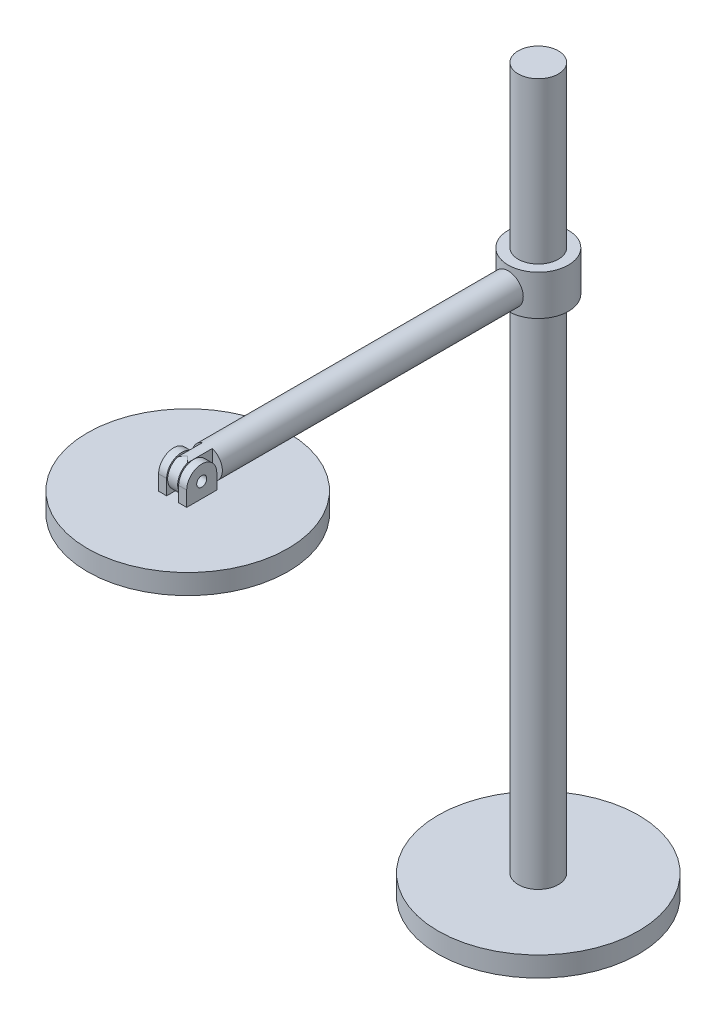
ISO-10303-21;
HEADER;
FILE_DESCRIPTION(('STEP AP214'),'2;1');
FILE_NAME('part.step','',(''),(''),'','','');
FILE_SCHEMA(('AUTOMOTIVE_DESIGN { 1 0 10303 214 1 1 1 1 }'));
ENDSEC;
DATA;
#1=APPLICATION_CONTEXT('core data for automotive mechanical design processes');
#2=APPLICATION_PROTOCOL_DEFINITION('international standard','automotive_design',2000,#1);
#3=PRODUCT_CONTEXT('',#1,'mechanical');
#4=PRODUCT('Part','Part','',(#3));
#5=PRODUCT_RELATED_PRODUCT_CATEGORY('part','',(#4));
#6=PRODUCT_DEFINITION_FORMATION('','',#4);
#7=PRODUCT_DEFINITION_CONTEXT('part definition',#1,'design');
#8=PRODUCT_DEFINITION('design','',#6,#7);
#9=PRODUCT_DEFINITION_SHAPE('','',#8);
#10=(LENGTH_UNIT() NAMED_UNIT(*) SI_UNIT(.MILLI.,.METRE.));
#11=(NAMED_UNIT(*) PLANE_ANGLE_UNIT() SI_UNIT($,.RADIAN.));
#12=(NAMED_UNIT(*) SI_UNIT($,.STERADIAN.) SOLID_ANGLE_UNIT());
#13=UNCERTAINTY_MEASURE_WITH_UNIT(LENGTH_MEASURE(1.E-05),#10,'distance_accuracy_value','');
#14=(GEOMETRIC_REPRESENTATION_CONTEXT(3) GLOBAL_UNCERTAINTY_ASSIGNED_CONTEXT((#13)) GLOBAL_UNIT_ASSIGNED_CONTEXT((#10,
#11,#12)) REPRESENTATION_CONTEXT('',''));
#15=CARTESIAN_POINT('',(0.,0.,0.));
#16=DIRECTION('',(0.,0.,1.));
#17=DIRECTION('',(1.,0.,0.));
#18=AXIS2_PLACEMENT_3D('',#15,#16,#17);
#19=CARTESIAN_POINT('',(0.,262.5,2.91433543964104E-13));
#20=DIRECTION('',(0.,1.,0.));
#21=DIRECTION('',(0.,0.,1.));
#22=AXIS2_PLACEMENT_3D('',#19,#20,#21);
#23=PLANE('',#22);
#24=CARTESIAN_POINT('',(0.,262.5,174.780705462269));
#25=DIRECTION('',(0.,1.,0.));
#26=DIRECTION('',(0.,0.,1.));
#27=AXIS2_PLACEMENT_3D('',#24,#25,#26);
#28=CIRCLE('',#27,50.);
#29=CARTESIAN_POINT('',(0.,262.5,224.780705462269));
#30=VERTEX_POINT('',#29);
#31=EDGE_CURVE('E169',#30,#30,#28,.T.);
#32=ORIENTED_EDGE('',*,*,#31,.T.);
#33=EDGE_LOOP('',(#32));
#34=FACE_BOUND('',#33,.T.);
#35=DIRECTION('',(0.,0.,1.));
#36=VECTOR('',#35,1.);
#37=CARTESIAN_POINT('',(3.,262.500000000001,1.48983907698869E-12));
#38=LINE('',#37,#36);
#39=CARTESIAN_POINT('',(3.,262.5,167.280705462269));
#40=VERTEX_POINT('',#39);
#41=CARTESIAN_POINT('',(3.,262.5,182.280705462269));
#42=VERTEX_POINT('',#41);
#43=EDGE_CURVE('E194',#40,#42,#38,.T.);
#44=ORIENTED_EDGE('',*,*,#43,.F.);
#45=DIRECTION('',(-1.,0.,0.));
#46=VECTOR('',#45,1.);
#47=CARTESIAN_POINT('',(7.,262.5,167.280705462269));
#48=LINE('',#47,#46);
#49=CARTESIAN_POINT('',(7.,262.5,167.280705462269));
#50=VERTEX_POINT('',#49);
#51=EDGE_CURVE('E202',#50,#40,#48,.T.);
#52=ORIENTED_EDGE('',*,*,#51,.F.);
#53=DIRECTION('',(0.,0.,1.));
#54=VECTOR('',#53,1.);
#55=CARTESIAN_POINT('',(7.,262.500000000001,1.48983907698869E-12));
#56=LINE('',#55,#54);
#57=CARTESIAN_POINT('',(7.,262.5,182.280705462269));
#58=VERTEX_POINT('',#57);
#59=EDGE_CURVE('E179',#50,#58,#56,.T.);
#60=ORIENTED_EDGE('',*,*,#59,.T.);
#61=DIRECTION('',(-1.,0.,0.));
#62=VECTOR('',#61,1.);
#63=CARTESIAN_POINT('',(7.,262.5,182.280705462269));
#64=LINE('',#63,#62);
#65=EDGE_CURVE('E64',#58,#42,#64,.T.);
#66=ORIENTED_EDGE('',*,*,#65,.T.);
#67=EDGE_LOOP('',(#44,#52,#60,#66));
#68=FACE_BOUND('',#67,.T.);
#69=DIRECTION('',(1.,0.,0.));
#70=VECTOR('',#69,1.);
#71=CARTESIAN_POINT('',(-7.,262.5,182.280705462269));
#72=LINE('',#71,#70);
#73=CARTESIAN_POINT('',(-7.,262.5,182.280705462269));
#74=VERTEX_POINT('',#73);
#75=CARTESIAN_POINT('',(-3.,262.5,182.280705462269));
#76=VERTEX_POINT('',#75);
#77=EDGE_CURVE('E76',#74,#76,#72,.T.);
#78=ORIENTED_EDGE('',*,*,#77,.F.);
#79=DIRECTION('',(0.,0.,1.));
#80=VECTOR('',#79,1.);
#81=CARTESIAN_POINT('',(-7.,262.500000000001,1.48983907698869E-12));
#82=LINE('',#81,#80);
#83=CARTESIAN_POINT('',(-7.,262.5,167.280705462269));
#84=VERTEX_POINT('',#83);
#85=EDGE_CURVE('E71',#84,#74,#82,.T.);
#86=ORIENTED_EDGE('',*,*,#85,.F.);
#87=DIRECTION('',(1.,0.,0.));
#88=VECTOR('',#87,1.);
#89=CARTESIAN_POINT('',(-7.,262.5,167.280705462269));
#90=LINE('',#89,#88);
#91=CARTESIAN_POINT('',(-3.,262.5,167.280705462269));
#92=VERTEX_POINT('',#91);
#93=EDGE_CURVE('E164',#84,#92,#90,.T.);
#94=ORIENTED_EDGE('',*,*,#93,.T.);
#95=DIRECTION('',(0.,0.,1.));
#96=VECTOR('',#95,1.);
#97=CARTESIAN_POINT('',(-3.,262.500000000001,1.48983907698869E-12));
#98=LINE('',#97,#96);
#99=EDGE_CURVE('E158',#92,#76,#98,.T.);
#100=ORIENTED_EDGE('',*,*,#99,.T.);
#101=EDGE_LOOP('',(#78,#86,#94,#100));
#102=FACE_BOUND('',#101,.T.);
#103=ADVANCED_FACE('F56',(#34,#68,#102),#23,.T.);
#104=CARTESIAN_POINT('',(7.,270.,174.780705462269));
#105=DIRECTION('',(-1.,0.,0.));
#106=DIRECTION('',(0.,0.,1.));
#107=AXIS2_PLACEMENT_3D('',#104,#105,#106);
#108=CYLINDRICAL_SURFACE('',#107,7.50000000000003);
#109=CARTESIAN_POINT('',(3.,270.,174.780705462269));
#110=DIRECTION('',(1.,0.,0.));
#111=DIRECTION('',(0.,0.,-1.));
#112=AXIS2_PLACEMENT_3D('',#109,#110,#111);
#113=CIRCLE('',#112,7.50000000000003);
#114=CARTESIAN_POINT('',(3.,270.,167.280705462269));
#115=VERTEX_POINT('',#114);
#116=CARTESIAN_POINT('',(3.,270.,182.280705462269));
#117=VERTEX_POINT('',#116);
#118=EDGE_CURVE('E172',#115,#117,#113,.T.);
#119=ORIENTED_EDGE('',*,*,#118,.T.);
#120=DIRECTION('',(-1.,0.,0.));
#121=VECTOR('',#120,1.);
#122=CARTESIAN_POINT('',(7.,270.,182.280705462269));
#123=LINE('',#122,#121);
#124=CARTESIAN_POINT('',(7.,270.,182.280705462269));
#125=VERTEX_POINT('',#124);
#126=EDGE_CURVE('E12',#125,#117,#123,.T.);
#127=ORIENTED_EDGE('',*,*,#126,.F.);
#128=CARTESIAN_POINT('',(7.,270.,174.780705462269));
#129=DIRECTION('',(1.,0.,0.));
#130=DIRECTION('',(0.,0.,-1.));
#131=AXIS2_PLACEMENT_3D('',#128,#129,#130);
#132=CIRCLE('',#131,7.50000000000003);
#133=CARTESIAN_POINT('',(7.,270.,167.280705462269));
#134=VERTEX_POINT('',#133);
#135=EDGE_CURVE('E173',#134,#125,#132,.T.);
#136=ORIENTED_EDGE('',*,*,#135,.F.);
#137=DIRECTION('',(-1.,0.,0.));
#138=VECTOR('',#137,1.);
#139=CARTESIAN_POINT('',(7.,270.,167.280705462269));
#140=LINE('',#139,#138);
#141=EDGE_CURVE('E188',#134,#115,#140,.T.);
#142=ORIENTED_EDGE('',*,*,#141,.T.);
#143=EDGE_LOOP('',(#119,#127,#136,#142));
#144=FACE_BOUND('',#143,.T.);
#145=ADVANCED_FACE('F58',(#144),#108,.T.);
#146=CARTESIAN_POINT('',(7.,0.,182.280705462269));
#147=DIRECTION('',(0.,0.,-1.));
#148=DIRECTION('',(-1.,0.,0.));
#149=AXIS2_PLACEMENT_3D('',#146,#147,#148);
#150=PLANE('',#149);
#151=DIRECTION('',(0.,-1.,0.));
#152=VECTOR('',#151,1.);
#153=CARTESIAN_POINT('',(3.,0.,182.280705462269));
#154=LINE('',#153,#152);
#155=EDGE_CURVE('E191',#117,#42,#154,.T.);
#156=ORIENTED_EDGE('',*,*,#155,.T.);
#157=ORIENTED_EDGE('',*,*,#65,.F.);
#158=DIRECTION('',(0.,-1.,0.));
#159=VECTOR('',#158,1.);
#160=CARTESIAN_POINT('',(7.,0.,182.280705462269));
#161=LINE('',#160,#159);
#162=EDGE_CURVE('E176',#125,#58,#161,.T.);
#163=ORIENTED_EDGE('',*,*,#162,.F.);
#164=ORIENTED_EDGE('',*,*,#126,.T.);
#165=EDGE_LOOP('',(#156,#157,#163,#164));
#166=FACE_BOUND('',#165,.T.);
#167=ADVANCED_FACE('F209',(#166),#150,.F.);
#168=CARTESIAN_POINT('',(7.,0.,167.280705462269));
#169=DIRECTION('',(0.,0.,-1.));
#170=DIRECTION('',(-1.,0.,0.));
#171=AXIS2_PLACEMENT_3D('',#168,#169,#170);
#172=PLANE('',#171);
#173=DIRECTION('',(0.,-1.,0.));
#174=VECTOR('',#173,1.);
#175=CARTESIAN_POINT('',(3.,0.,167.280705462269));
#176=LINE('',#175,#174);
#177=EDGE_CURVE('E196',#115,#40,#176,.T.);
#178=ORIENTED_EDGE('',*,*,#177,.F.);
#179=ORIENTED_EDGE('',*,*,#141,.F.);
#180=DIRECTION('',(0.,-1.,0.));
#181=VECTOR('',#180,1.);
#182=CARTESIAN_POINT('',(7.,0.,167.280705462269));
#183=LINE('',#182,#181);
#184=EDGE_CURVE('E182',#134,#50,#183,.T.);
#185=ORIENTED_EDGE('',*,*,#184,.T.);
#186=ORIENTED_EDGE('',*,*,#51,.T.);
#187=EDGE_LOOP('',(#178,#179,#185,#186));
#188=FACE_BOUND('',#187,.T.);
#189=ADVANCED_FACE('F217',(#188),#172,.T.);
#190=CARTESIAN_POINT('',(7.,270.,174.780705462269));
#191=DIRECTION('',(-1.,0.,0.));
#192=DIRECTION('',(0.,0.,1.));
#193=AXIS2_PLACEMENT_3D('',#190,#191,#192);
#194=CYLINDRICAL_SURFACE('',#193,2.5);
#195=CARTESIAN_POINT('',(7.,270.,174.780705462269));
#196=DIRECTION('',(1.,0.,0.));
#197=DIRECTION('',(0.,0.,-1.));
#198=AXIS2_PLACEMENT_3D('',#195,#196,#197);
#199=CIRCLE('',#198,2.5);
#200=CARTESIAN_POINT('',(7.,270.,172.280705462269));
#201=VERTEX_POINT('',#200);
#202=EDGE_CURVE('E185',#201,#201,#199,.T.);
#203=ORIENTED_EDGE('',*,*,#202,.T.);
#204=EDGE_LOOP('',(#203));
#205=FACE_BOUND('',#204,.T.);
#206=CARTESIAN_POINT('',(3.,270.,174.780705462269));
#207=DIRECTION('',(1.,0.,0.));
#208=DIRECTION('',(0.,0.,-1.));
#209=AXIS2_PLACEMENT_3D('',#206,#207,#208);
#210=CIRCLE('',#209,2.5);
#211=CARTESIAN_POINT('',(3.,270.,172.280705462269));
#212=VERTEX_POINT('',#211);
#213=EDGE_CURVE('E177',#212,#212,#210,.T.);
#214=ORIENTED_EDGE('',*,*,#213,.F.);
#215=EDGE_LOOP('',(#214));
#216=FACE_BOUND('',#215,.T.);
#217=ADVANCED_FACE('F243',(#205,#216),#194,.F.);
#218=CARTESIAN_POINT('',(7.,0.,0.));
#219=DIRECTION('',(1.,0.,0.));
#220=DIRECTION('',(0.,0.,-1.));
#221=AXIS2_PLACEMENT_3D('',#218,#219,#220);
#222=PLANE('',#221);
#223=ORIENTED_EDGE('',*,*,#135,.T.);
#224=ORIENTED_EDGE('',*,*,#162,.T.);
#225=ORIENTED_EDGE('',*,*,#59,.F.);
#226=ORIENTED_EDGE('',*,*,#184,.F.);
#227=EDGE_LOOP('',(#223,#224,#225,#226));
#228=FACE_BOUND('',#227,.T.);
#229=ORIENTED_EDGE('',*,*,#202,.F.);
#230=EDGE_LOOP('',(#229));
#231=FACE_BOUND('',#230,.T.);
#232=ADVANCED_FACE('F221',(#228,#231),#222,.T.);
#233=CARTESIAN_POINT('',(3.,0.,0.));
#234=DIRECTION('',(1.,0.,0.));
#235=DIRECTION('',(0.,0.,-1.));
#236=AXIS2_PLACEMENT_3D('',#233,#234,#235);
#237=PLANE('',#236);
#238=ORIENTED_EDGE('',*,*,#118,.F.);
#239=ORIENTED_EDGE('',*,*,#177,.T.);
#240=ORIENTED_EDGE('',*,*,#43,.T.);
#241=ORIENTED_EDGE('',*,*,#155,.F.);
#242=EDGE_LOOP('',(#238,#239,#240,#241));
#243=FACE_BOUND('',#242,.T.);
#244=ORIENTED_EDGE('',*,*,#213,.T.);
#245=EDGE_LOOP('',(#244));
#246=FACE_BOUND('',#245,.T.);
#247=ADVANCED_FACE('F213',(#243,#246),#237,.F.);
#248=CARTESIAN_POINT('',(0.,262.5,174.780705462269));
#249=DIRECTION('',(0.,1.,0.));
#250=DIRECTION('',(0.,0.,1.));
#251=AXIS2_PLACEMENT_3D('',#248,#249,#250);
#252=CYLINDRICAL_SURFACE('',#251,50.);
#253=CARTESIAN_POINT('',(0.,252.5,174.780705462269));
#254=DIRECTION('',(0.,1.,0.));
#255=DIRECTION('',(0.,0.,1.));
#256=AXIS2_PLACEMENT_3D('',#253,#254,#255);
#257=CIRCLE('',#256,50.);
#258=CARTESIAN_POINT('',(0.,252.5,224.780705462269));
#259=VERTEX_POINT('',#258);
#260=EDGE_CURVE('E163',#259,#259,#257,.T.);
#261=ORIENTED_EDGE('',*,*,#260,.T.);
#262=EDGE_LOOP('',(#261));
#263=FACE_BOUND('',#262,.T.);
#264=ORIENTED_EDGE('',*,*,#31,.F.);
#265=EDGE_LOOP('',(#264));
#266=FACE_BOUND('',#265,.T.);
#267=ADVANCED_FACE('F237',(#263,#266),#252,.T.);
#268=CARTESIAN_POINT('',(0.,252.5,0.));
#269=DIRECTION('',(0.,1.,0.));
#270=DIRECTION('',(0.,0.,1.));
#271=AXIS2_PLACEMENT_3D('',#268,#269,#270);
#272=PLANE('',#271);
#273=CARTESIAN_POINT('',(0.,252.5,174.780705462269));
#274=DIRECTION('',(0.,-1.,0.));
#275=DIRECTION('',(0.,0.,-1.));
#276=AXIS2_PLACEMENT_3D('',#273,#274,#275);
#277=CIRCLE('',#276,40.);
#278=CARTESIAN_POINT('',(0.,252.5,134.780705462269));
#279=VERTEX_POINT('',#278);
#280=EDGE_CURVE('E146',#279,#279,#277,.T.);
#281=ORIENTED_EDGE('',*,*,#280,.F.);
#282=EDGE_LOOP('',(#281));
#283=FACE_BOUND('',#282,.T.);
#284=ORIENTED_EDGE('',*,*,#260,.F.);
#285=EDGE_LOOP('',(#284));
#286=FACE_BOUND('',#285,.T.);
#287=ADVANCED_FACE('F235',(#283,#286),#272,.F.);
#288=CARTESIAN_POINT('',(-7.,270.,174.780705462269));
#289=DIRECTION('',(1.,0.,0.));
#290=DIRECTION('',(0.,0.,-1.));
#291=AXIS2_PLACEMENT_3D('',#288,#289,#290);
#292=CYLINDRICAL_SURFACE('',#291,7.50000000000003);
#293=CARTESIAN_POINT('',(-3.,270.,174.780705462269));
#294=DIRECTION('',(1.,0.,0.));
#295=DIRECTION('',(0.,0.,-1.));
#296=AXIS2_PLACEMENT_3D('',#293,#294,#295);
#297=CIRCLE('',#296,7.50000000000003);
#298=CARTESIAN_POINT('',(-3.,270.,167.280705462269));
#299=VERTEX_POINT('',#298);
#300=CARTESIAN_POINT('',(-3.,270.,182.280705462269));
#301=VERTEX_POINT('',#300);
#302=EDGE_CURVE('E154',#299,#301,#297,.T.);
#303=ORIENTED_EDGE('',*,*,#302,.F.);
#304=DIRECTION('',(1.,0.,0.));
#305=VECTOR('',#304,1.);
#306=CARTESIAN_POINT('',(-7.,270.,167.280705462269));
#307=LINE('',#306,#305);
#308=CARTESIAN_POINT('',(-7.,270.,167.280705462269));
#309=VERTEX_POINT('',#308);
#310=EDGE_CURVE('E138',#309,#299,#307,.T.);
#311=ORIENTED_EDGE('',*,*,#310,.F.);
#312=CARTESIAN_POINT('',(-7.,270.,174.780705462269));
#313=DIRECTION('',(1.,0.,0.));
#314=DIRECTION('',(0.,0.,-1.));
#315=AXIS2_PLACEMENT_3D('',#312,#313,#314);
#316=CIRCLE('',#315,7.50000000000003);
#317=CARTESIAN_POINT('',(-7.,270.,182.280705462269));
#318=VERTEX_POINT('',#317);
#319=EDGE_CURVE('E135',#309,#318,#316,.T.);
#320=ORIENTED_EDGE('',*,*,#319,.T.);
#321=DIRECTION('',(1.,0.,0.));
#322=VECTOR('',#321,1.);
#323=CARTESIAN_POINT('',(-7.,270.,182.280705462269));
#324=LINE('',#323,#322);
#325=EDGE_CURVE('E119',#318,#301,#324,.T.);
#326=ORIENTED_EDGE('',*,*,#325,.T.);
#327=EDGE_LOOP('',(#303,#311,#320,#326));
#328=FACE_BOUND('',#327,.T.);
#329=ADVANCED_FACE('F137',(#328),#292,.T.);
#330=CARTESIAN_POINT('',(-7.,0.,167.280705462269));
#331=DIRECTION('',(0.,0.,1.));
#332=DIRECTION('',(1.,0.,0.));
#333=AXIS2_PLACEMENT_3D('',#330,#331,#332);
#334=PLANE('',#333);
#335=DIRECTION('',(0.,-1.,0.));
#336=VECTOR('',#335,1.);
#337=CARTESIAN_POINT('',(-3.,0.,167.280705462269));
#338=LINE('',#337,#336);
#339=EDGE_CURVE('E143',#299,#92,#338,.T.);
#340=ORIENTED_EDGE('',*,*,#339,.T.);
#341=ORIENTED_EDGE('',*,*,#93,.F.);
#342=DIRECTION('',(0.,-1.,0.));
#343=VECTOR('',#342,1.);
#344=CARTESIAN_POINT('',(-7.,0.,167.280705462269));
#345=LINE('',#344,#343);
#346=EDGE_CURVE('E150',#309,#84,#345,.T.);
#347=ORIENTED_EDGE('',*,*,#346,.F.);
#348=ORIENTED_EDGE('',*,*,#310,.T.);
#349=EDGE_LOOP('',(#340,#341,#347,#348));
#350=FACE_BOUND('',#349,.T.);
#351=ADVANCED_FACE('F284',(#350),#334,.F.);
#352=CARTESIAN_POINT('',(-7.,0.,182.280705462269));
#353=DIRECTION('',(0.,0.,1.));
#354=DIRECTION('',(1.,0.,0.));
#355=AXIS2_PLACEMENT_3D('',#352,#353,#354);
#356=PLANE('',#355);
#357=DIRECTION('',(0.,-1.,0.));
#358=VECTOR('',#357,1.);
#359=CARTESIAN_POINT('',(-3.,0.,182.280705462269));
#360=LINE('',#359,#358);
#361=EDGE_CURVE('E124',#301,#76,#360,.T.);
#362=ORIENTED_EDGE('',*,*,#361,.F.);
#363=ORIENTED_EDGE('',*,*,#325,.F.);
#364=DIRECTION('',(0.,-1.,0.));
#365=VECTOR('',#364,1.);
#366=CARTESIAN_POINT('',(-7.,0.,182.280705462269));
#367=LINE('',#366,#365);
#368=EDGE_CURVE('E122',#318,#74,#367,.T.);
#369=ORIENTED_EDGE('',*,*,#368,.T.);
#370=ORIENTED_EDGE('',*,*,#77,.T.);
#371=EDGE_LOOP('',(#362,#363,#369,#370));
#372=FACE_BOUND('',#371,.T.);
#373=ADVANCED_FACE('F121',(#372),#356,.T.);
#374=CARTESIAN_POINT('',(-7.,270.,174.780705462269));
#375=DIRECTION('',(1.,0.,0.));
#376=DIRECTION('',(0.,0.,-1.));
#377=AXIS2_PLACEMENT_3D('',#374,#375,#376);
#378=CYLINDRICAL_SURFACE('',#377,2.5);
#379=CARTESIAN_POINT('',(-7.,270.,174.780705462269));
#380=DIRECTION('',(1.,0.,0.));
#381=DIRECTION('',(0.,0.,-1.));
#382=AXIS2_PLACEMENT_3D('',#379,#380,#381);
#383=CIRCLE('',#382,2.5);
#384=CARTESIAN_POINT('',(-7.,270.,172.280705462269));
#385=VERTEX_POINT('',#384);
#386=EDGE_CURVE('E129',#385,#385,#383,.T.);
#387=ORIENTED_EDGE('',*,*,#386,.F.);
#388=EDGE_LOOP('',(#387));
#389=FACE_BOUND('',#388,.T.);
#390=CARTESIAN_POINT('',(-3.,270.,174.780705462269));
#391=DIRECTION('',(1.,0.,0.));
#392=DIRECTION('',(0.,0.,-1.));
#393=AXIS2_PLACEMENT_3D('',#390,#391,#392);
#394=CIRCLE('',#393,2.5);
#395=CARTESIAN_POINT('',(-3.,270.,172.280705462269));
#396=VERTEX_POINT('',#395);
#397=EDGE_CURVE('E140',#396,#396,#394,.T.);
#398=ORIENTED_EDGE('',*,*,#397,.T.);
#399=EDGE_LOOP('',(#398));
#400=FACE_BOUND('',#399,.T.);
#401=ADVANCED_FACE('F297',(#389,#400),#378,.F.);
#402=CARTESIAN_POINT('',(-7.,0.,0.));
#403=DIRECTION('',(1.,0.,0.));
#404=DIRECTION('',(0.,0.,-1.));
#405=AXIS2_PLACEMENT_3D('',#402,#403,#404);
#406=PLANE('',#405);
#407=ORIENTED_EDGE('',*,*,#319,.F.);
#408=ORIENTED_EDGE('',*,*,#346,.T.);
#409=ORIENTED_EDGE('',*,*,#85,.T.);
#410=ORIENTED_EDGE('',*,*,#368,.F.);
#411=EDGE_LOOP('',(#407,#408,#409,#410));
#412=FACE_BOUND('',#411,.T.);
#413=ORIENTED_EDGE('',*,*,#386,.T.);
#414=EDGE_LOOP('',(#413));
#415=FACE_BOUND('',#414,.T.);
#416=ADVANCED_FACE('F133',(#412,#415),#406,.F.);
#417=CARTESIAN_POINT('',(-3.,0.,0.));
#418=DIRECTION('',(1.,0.,0.));
#419=DIRECTION('',(0.,0.,-1.));
#420=AXIS2_PLACEMENT_3D('',#417,#418,#419);
#421=PLANE('',#420);
#422=ORIENTED_EDGE('',*,*,#302,.T.);
#423=ORIENTED_EDGE('',*,*,#361,.T.);
#424=ORIENTED_EDGE('',*,*,#99,.F.);
#425=ORIENTED_EDGE('',*,*,#339,.F.);
#426=EDGE_LOOP('',(#422,#423,#424,#425));
#427=FACE_BOUND('',#426,.T.);
#428=ORIENTED_EDGE('',*,*,#397,.F.);
#429=EDGE_LOOP('',(#428));
#430=FACE_BOUND('',#429,.T.);
#431=ADVANCED_FACE('F311',(#427,#430),#421,.T.);
#432=CARTESIAN_POINT('',(0.,254.5,174.780705462269));
#433=DIRECTION('',(0.,-1.,0.));
#434=DIRECTION('',(0.,0.,-1.));
#435=AXIS2_PLACEMENT_3D('',#432,#433,#434);
#436=CYLINDRICAL_SURFACE('',#435,40.);
#437=CARTESIAN_POINT('',(0.,254.5,174.780705462269));
#438=DIRECTION('',(0.,-1.,0.));
#439=DIRECTION('',(0.,0.,-1.));
#440=AXIS2_PLACEMENT_3D('',#437,#438,#439);
#441=CIRCLE('',#440,40.);
#442=CARTESIAN_POINT('',(0.,254.5,134.780705462269));
#443=VERTEX_POINT('',#442);
#444=EDGE_CURVE('E156',#443,#443,#441,.T.);
#445=ORIENTED_EDGE('',*,*,#444,.F.);
#446=EDGE_LOOP('',(#445));
#447=FACE_BOUND('',#446,.T.);
#448=ORIENTED_EDGE('',*,*,#280,.T.);
#449=EDGE_LOOP('',(#448));
#450=FACE_BOUND('',#449,.T.);
#451=ADVANCED_FACE('F317',(#447,#450),#436,.F.);
#452=CARTESIAN_POINT('',(0.,254.5,174.780705462269));
#453=DIRECTION('',(0.,-1.,0.));
#454=DIRECTION('',(0.,0.,-1.));
#455=AXIS2_PLACEMENT_3D('',#452,#453,#454);
#456=PLANE('',#455);
#457=ORIENTED_EDGE('',*,*,#444,.T.);
#458=EDGE_LOOP('',(#457));
#459=FACE_BOUND('',#458,.T.);
#460=ADVANCED_FACE('F324',(#459),#456,.T.);
#461=CLOSED_SHELL('',(#103,#145,#167,#189,#217,#232,#247,#267,#287,#329,#351,#373,#401,#416,
#431,#451,#460));
#462=MANIFOLD_SOLID_BREP('B2',#461);
#463=CARTESIAN_POINT('',(0.,0.,165.));
#464=DIRECTION('',(0.,0.,1.));
#465=DIRECTION('',(1.,0.,0.));
#466=AXIS2_PLACEMENT_3D('',#463,#464,#465);
#467=PLANE('',#466);
#468=CARTESIAN_POINT('',(0.,270.,165.));
#469=DIRECTION('',(0.,0.,1.));
#470=DIRECTION('',(1.,0.,0.));
#471=AXIS2_PLACEMENT_3D('',#468,#469,#470);
#472=CIRCLE('',#471,7.5);
#473=CARTESIAN_POINT('',(2.5,262.928932188135,165.));
#474=VERTEX_POINT('',#473);
#475=CARTESIAN_POINT('',(2.5,277.071067811865,165.));
#476=VERTEX_POINT('',#475);
#477=EDGE_CURVE('E549',#474,#476,#472,.T.);
#478=ORIENTED_EDGE('',*,*,#477,.T.);
#479=DIRECTION('',(0.,-1.,0.));
#480=VECTOR('',#479,1.);
#481=CARTESIAN_POINT('',(2.5,0.,165.));
#482=LINE('',#481,#480);
#483=EDGE_CURVE('E557',#476,#474,#482,.T.);
#484=ORIENTED_EDGE('',*,*,#483,.T.);
#485=EDGE_LOOP('',(#478,#484));
#486=FACE_BOUND('',#485,.T.);
#487=ADVANCED_FACE('F500',(#486),#467,.T.);
#488=CARTESIAN_POINT('',(0.,270.,165.));
#489=DIRECTION('',(0.,0.,-1.));
#490=DIRECTION('',(-1.,0.,0.));
#491=AXIS2_PLACEMENT_3D('',#488,#489,#490);
#492=CYLINDRICAL_SURFACE('',#491,7.5);
#493=DIRECTION('',(0.,0.,-1.));
#494=VECTOR('',#493,1.);
#495=CARTESIAN_POINT('',(2.5,277.071067811865,180.));
#496=LINE('',#495,#494);
#497=CARTESIAN_POINT('',(2.5,277.071067811865,177.280705462269));
#498=VERTEX_POINT('',#497);
#499=EDGE_CURVE('E545',#498,#476,#496,.T.);
#500=ORIENTED_EDGE('',*,*,#499,.T.);
#501=ORIENTED_EDGE('',*,*,#477,.F.);
#502=DIRECTION('',(0.,0.,-1.));
#503=VECTOR('',#502,1.);
#504=CARTESIAN_POINT('',(2.5,262.928932188135,180.));
#505=LINE('',#504,#503);
#506=CARTESIAN_POINT('',(2.5,262.928932188135,177.280705462269));
#507=VERTEX_POINT('',#506);
#508=EDGE_CURVE('E560',#474,#507,#505,.F.);
#509=ORIENTED_EDGE('',*,*,#508,.T.);
#510=CARTESIAN_POINT('',(0.,270.,174.780705462269));
#511=DIRECTION('',(-0.707106781186547,0.,0.707106781186547));
#512=DIRECTION('',(-0.707106781186547,0.,-0.707106781186547));
#513=AXIS2_PLACEMENT_3D('',#510,#511,#512);
#514=ELLIPSE('',#513,10.6066017177983,7.50000000000003);
#515=CARTESIAN_POINT('',(0.,262.5,174.780705462269));
#516=VERTEX_POINT('',#515);
#517=EDGE_CURVE('E589',#516,#507,#514,.T.);
#518=ORIENTED_EDGE('',*,*,#517,.F.);
#519=CARTESIAN_POINT('',(0.,270.,174.780705462269));
#520=DIRECTION('',(-0.707106781186547,0.,-0.707106781186547));
#521=DIRECTION('',(-0.707106781186547,0.,0.707106781186547));
#522=AXIS2_PLACEMENT_3D('',#519,#520,#521);
#523=ELLIPSE('',#522,10.6066017177983,7.50000000000003);
#524=CARTESIAN_POINT('',(-2.5,262.928932188135,177.280705462269));
#525=VERTEX_POINT('',#524);
#526=EDGE_CURVE('E515',#525,#516,#523,.F.);
#527=ORIENTED_EDGE('',*,*,#526,.F.);
#528=DIRECTION('',(0.,0.,-1.));
#529=VECTOR('',#528,1.);
#530=CARTESIAN_POINT('',(-2.5,262.928932188135,180.));
#531=LINE('',#530,#529);
#532=CARTESIAN_POINT('',(-2.5,262.928932188135,165.));
#533=VERTEX_POINT('',#532);
#534=EDGE_CURVE('E54',#533,#525,#531,.F.);
#535=ORIENTED_EDGE('',*,*,#534,.F.);
#536=CARTESIAN_POINT('',(-2.5,277.071067811866,165.));
#537=VERTEX_POINT('',#536);
#538=EDGE_CURVE('E563',#537,#533,#472,.T.);
#539=ORIENTED_EDGE('',*,*,#538,.F.);
#540=DIRECTION('',(0.,0.,-1.));
#541=VECTOR('',#540,1.);
#542=CARTESIAN_POINT('',(-2.5,277.071067811865,180.));
#543=LINE('',#542,#541);
#544=CARTESIAN_POINT('',(-2.5,277.071067811865,177.280705462269));
#545=VERTEX_POINT('',#544);
#546=EDGE_CURVE('E508',#545,#537,#543,.T.);
#547=ORIENTED_EDGE('',*,*,#546,.F.);
#548=CARTESIAN_POINT('',(0.,277.5,174.780705462269));
#549=VERTEX_POINT('',#548);
#550=EDGE_CURVE('E579',#549,#545,#523,.F.);
#551=ORIENTED_EDGE('',*,*,#550,.F.);
#552=EDGE_CURVE('E551',#498,#549,#514,.T.);
#553=ORIENTED_EDGE('',*,*,#552,.F.);
#554=EDGE_LOOP('',(#500,#501,#509,#518,#527,#535,#539,#547,#551,#553));
#555=FACE_BOUND('',#554,.T.);
#556=CARTESIAN_POINT('',(0.,270.,15.));
#557=DIRECTION('',(0.,0.,1.));
#558=DIRECTION('',(1.,0.,0.));
#559=AXIS2_PLACEMENT_3D('',#556,#557,#558);
#560=CIRCLE('',#559,7.5);
#561=CARTESIAN_POINT('',(7.5,270.,15.));
#562=VERTEX_POINT('',#561);
#563=EDGE_CURVE('E565',#562,#562,#560,.T.);
#564=ORIENTED_EDGE('',*,*,#563,.T.);
#565=EDGE_LOOP('',(#564));
#566=FACE_BOUND('',#565,.T.);
#567=ADVANCED_FACE('F502',(#555,#566),#492,.T.);
#568=DIRECTION('',(0.,-1.,0.));
#569=VECTOR('',#568,1.);
#570=CARTESIAN_POINT('',(-2.5,0.,165.));
#571=LINE('',#570,#569);
#572=EDGE_CURVE('E562',#537,#533,#571,.T.);
#573=ORIENTED_EDGE('',*,*,#572,.F.);
#574=ORIENTED_EDGE('',*,*,#538,.T.);
#575=EDGE_LOOP('',(#573,#574));
#576=FACE_BOUND('',#575,.T.);
#577=ADVANCED_FACE('F577',(#576),#467,.T.);
#578=CARTESIAN_POINT('',(0.,0.,15.));
#579=DIRECTION('',(0.,0.,1.));
#580=DIRECTION('',(1.,0.,0.));
#581=AXIS2_PLACEMENT_3D('',#578,#579,#580);
#582=PLANE('',#581);
#583=ORIENTED_EDGE('',*,*,#563,.F.);
#584=EDGE_LOOP('',(#583));
#585=FACE_BOUND('',#584,.T.);
#586=ADVANCED_FACE('F607',(#585),#582,.F.);
#587=CARTESIAN_POINT('',(2.5,270.,174.780705462269));
#588=DIRECTION('',(-1.,0.,0.));
#589=DIRECTION('',(0.,0.,1.));
#590=AXIS2_PLACEMENT_3D('',#587,#588,#589);
#591=CYLINDRICAL_SURFACE('',#590,7.50000000000006);
#592=CARTESIAN_POINT('',(-2.5,270.,174.780705462269));
#593=DIRECTION('',(1.,0.,0.));
#594=DIRECTION('',(0.,0.,-1.));
#595=AXIS2_PLACEMENT_3D('',#592,#593,#594);
#596=CIRCLE('',#595,7.50000000000006);
#597=EDGE_CURVE('E582',#545,#525,#596,.T.);
#598=ORIENTED_EDGE('',*,*,#597,.T.);
#599=ORIENTED_EDGE('',*,*,#526,.T.);
#600=ORIENTED_EDGE('',*,*,#517,.T.);
#601=CARTESIAN_POINT('',(2.5,270.,174.780705462269));
#602=DIRECTION('',(1.,0.,0.));
#603=DIRECTION('',(0.,0.,-1.));
#604=AXIS2_PLACEMENT_3D('',#601,#602,#603);
#605=CIRCLE('',#604,7.50000000000006);
#606=EDGE_CURVE('E569',#498,#507,#605,.T.);
#607=ORIENTED_EDGE('',*,*,#606,.F.);
#608=ORIENTED_EDGE('',*,*,#552,.T.);
#609=ORIENTED_EDGE('',*,*,#550,.T.);
#610=EDGE_LOOP('',(#598,#599,#600,#607,#608,#609));
#611=FACE_BOUND('',#610,.T.);
#612=ADVANCED_FACE('F581',(#611),#591,.T.);
#613=CARTESIAN_POINT('',(2.5,270.,174.780705462269));
#614=DIRECTION('',(-1.,0.,0.));
#615=DIRECTION('',(0.,0.,1.));
#616=AXIS2_PLACEMENT_3D('',#613,#614,#615);
#617=CYLINDRICAL_SURFACE('',#616,2.5);
#618=CARTESIAN_POINT('',(2.5,270.,174.780705462269));
#619=DIRECTION('',(1.,0.,0.));
#620=DIRECTION('',(0.,0.,-1.));
#621=AXIS2_PLACEMENT_3D('',#618,#619,#620);
#622=CIRCLE('',#621,2.5);
#623=CARTESIAN_POINT('',(2.5,270.,172.280705462269));
#624=VERTEX_POINT('',#623);
#625=EDGE_CURVE('E584',#624,#624,#622,.T.);
#626=ORIENTED_EDGE('',*,*,#625,.T.);
#627=EDGE_LOOP('',(#626));
#628=FACE_BOUND('',#627,.T.);
#629=CARTESIAN_POINT('',(-2.5,270.,174.780705462269));
#630=DIRECTION('',(1.,0.,0.));
#631=DIRECTION('',(0.,0.,-1.));
#632=AXIS2_PLACEMENT_3D('',#629,#630,#631);
#633=CIRCLE('',#632,2.5);
#634=CARTESIAN_POINT('',(-2.5,270.,172.280705462269));
#635=VERTEX_POINT('',#634);
#636=EDGE_CURVE('E585',#635,#635,#633,.T.);
#637=ORIENTED_EDGE('',*,*,#636,.F.);
#638=EDGE_LOOP('',(#637));
#639=FACE_BOUND('',#638,.T.);
#640=ADVANCED_FACE('F598',(#628,#639),#617,.F.);
#641=CARTESIAN_POINT('',(2.5,0.,0.));
#642=DIRECTION('',(1.,0.,0.));
#643=DIRECTION('',(0.,0.,-1.));
#644=AXIS2_PLACEMENT_3D('',#641,#642,#643);
#645=PLANE('',#644);
#646=ORIENTED_EDGE('',*,*,#508,.F.);
#647=ORIENTED_EDGE('',*,*,#483,.F.);
#648=ORIENTED_EDGE('',*,*,#499,.F.);
#649=ORIENTED_EDGE('',*,*,#606,.T.);
#650=EDGE_LOOP('',(#646,#647,#648,#649));
#651=FACE_BOUND('',#650,.T.);
#652=ORIENTED_EDGE('',*,*,#625,.F.);
#653=EDGE_LOOP('',(#652));
#654=FACE_BOUND('',#653,.T.);
#655=ADVANCED_FACE('F558',(#651,#654),#645,.T.);
#656=CARTESIAN_POINT('',(-2.5,0.,0.));
#657=DIRECTION('',(1.,0.,0.));
#658=DIRECTION('',(0.,0.,-1.));
#659=AXIS2_PLACEMENT_3D('',#656,#657,#658);
#660=PLANE('',#659);
#661=ORIENTED_EDGE('',*,*,#636,.T.);
#662=EDGE_LOOP('',(#661));
#663=FACE_BOUND('',#662,.T.);
#664=ORIENTED_EDGE('',*,*,#572,.T.);
#665=ORIENTED_EDGE('',*,*,#534,.T.);
#666=ORIENTED_EDGE('',*,*,#597,.F.);
#667=ORIENTED_EDGE('',*,*,#546,.T.);
#668=EDGE_LOOP('',(#664,#665,#666,#667));
#669=FACE_BOUND('',#668,.T.);
#670=ADVANCED_FACE('F573',(#663,#669),#660,.F.);
#671=CLOSED_SHELL('',(#487,#567,#577,#586,#612,#640,#655,#670));
#672=MANIFOLD_SOLID_BREP('B6',#671);
#673=CARTESIAN_POINT('',(0.,360.,0.));
#674=DIRECTION('',(0.,-1.,0.));
#675=DIRECTION('',(0.,0.,-1.));
#676=AXIS2_PLACEMENT_3D('',#673,#674,#675);
#677=CYLINDRICAL_SURFACE('',#676,10.);
#678=CARTESIAN_POINT('',(0.,10.,0.));
#679=DIRECTION('',(0.,1.,0.));
#680=DIRECTION('',(0.,0.,1.));
#681=AXIS2_PLACEMENT_3D('',#678,#679,#680);
#682=CIRCLE('',#681,10.);
#683=CARTESIAN_POINT('',(0.,10.,10.));
#684=VERTEX_POINT('',#683);
#685=EDGE_CURVE('E727',#684,#684,#682,.T.);
#686=ORIENTED_EDGE('',*,*,#685,.T.);
#687=EDGE_LOOP('',(#686));
#688=FACE_BOUND('',#687,.T.);
#689=CARTESIAN_POINT('',(0.,260.,0.));
#690=DIRECTION('',(0.,1.,0.));
#691=DIRECTION('',(0.,0.,1.));
#692=AXIS2_PLACEMENT_3D('',#689,#690,#691);
#693=CIRCLE('',#692,10.);
#694=CARTESIAN_POINT('',(0.,260.,10.));
#695=VERTEX_POINT('',#694);
#696=EDGE_CURVE('E499',#695,#695,#693,.T.);
#697=ORIENTED_EDGE('',*,*,#696,.F.);
#698=EDGE_LOOP('',(#697));
#699=FACE_BOUND('',#698,.T.);
#700=ADVANCED_FACE('F720',(#688,#699),#677,.T.);
#701=CARTESIAN_POINT('',(0.,10.,0.));
#702=DIRECTION('',(0.,-1.,0.));
#703=DIRECTION('',(0.,0.,-1.));
#704=AXIS2_PLACEMENT_3D('',#701,#702,#703);
#705=CYLINDRICAL_SURFACE('',#704,50.);
#706=CARTESIAN_POINT('',(0.,10.,0.));
#707=DIRECTION('',(0.,1.,0.));
#708=DIRECTION('',(0.,0.,1.));
#709=AXIS2_PLACEMENT_3D('',#706,#707,#708);
#710=CIRCLE('',#709,50.);
#711=CARTESIAN_POINT('',(0.,10.,50.));
#712=VERTEX_POINT('',#711);
#713=EDGE_CURVE('E731',#712,#712,#710,.T.);
#714=ORIENTED_EDGE('',*,*,#713,.F.);
#715=EDGE_LOOP('',(#714));
#716=FACE_BOUND('',#715,.T.);
#717=CARTESIAN_POINT('',(0.,0.,0.));
#718=DIRECTION('',(0.,1.,0.));
#719=DIRECTION('',(0.,0.,1.));
#720=AXIS2_PLACEMENT_3D('',#717,#718,#719);
#721=CIRCLE('',#720,50.);
#722=CARTESIAN_POINT('',(0.,0.,50.));
#723=VERTEX_POINT('',#722);
#724=EDGE_CURVE('E736',#723,#723,#721,.T.);
#725=ORIENTED_EDGE('',*,*,#724,.T.);
#726=EDGE_LOOP('',(#725));
#727=FACE_BOUND('',#726,.T.);
#728=ADVANCED_FACE('F722',(#716,#727),#705,.T.);
#729=CARTESIAN_POINT('',(0.,10.,0.));
#730=DIRECTION('',(0.,1.,0.));
#731=DIRECTION('',(0.,0.,1.));
#732=AXIS2_PLACEMENT_3D('',#729,#730,#731);
#733=PLANE('',#732);
#734=ORIENTED_EDGE('',*,*,#685,.F.);
#735=EDGE_LOOP('',(#734));
#736=FACE_BOUND('',#735,.T.);
#737=ORIENTED_EDGE('',*,*,#713,.T.);
#738=EDGE_LOOP('',(#737));
#739=FACE_BOUND('',#738,.T.);
#740=ADVANCED_FACE('F780',(#736,#739),#733,.T.);
#741=CARTESIAN_POINT('',(0.,0.,0.));
#742=DIRECTION('',(0.,1.,0.));
#743=DIRECTION('',(0.,0.,1.));
#744=AXIS2_PLACEMENT_3D('',#741,#742,#743);
#745=PLANE('',#744);
#746=ORIENTED_EDGE('',*,*,#724,.F.);
#747=EDGE_LOOP('',(#746));
#748=FACE_BOUND('',#747,.T.);
#749=ADVANCED_FACE('F814',(#748),#745,.F.);
#750=CARTESIAN_POINT('',(0.,280.,0.));
#751=DIRECTION('',(0.,-1.,0.));
#752=DIRECTION('',(0.,0.,-1.));
#753=AXIS2_PLACEMENT_3D('',#750,#751,#752);
#754=CYLINDRICAL_SURFACE('',#753,15.);
#755=CARTESIAN_POINT('',(0.,280.,0.));
#756=DIRECTION('',(0.,1.,0.));
#757=DIRECTION('',(0.,0.,1.));
#758=AXIS2_PLACEMENT_3D('',#755,#756,#757);
#759=CIRCLE('',#758,15.);
#760=CARTESIAN_POINT('',(0.,280.,15.));
#761=VERTEX_POINT('',#760);
#762=EDGE_CURVE('E745',#761,#761,#759,.T.);
#763=ORIENTED_EDGE('',*,*,#762,.F.);
#764=EDGE_LOOP('',(#763));
#765=FACE_BOUND('',#764,.T.);
#766=CARTESIAN_POINT('',(0.,260.,0.));
#767=DIRECTION('',(0.,1.,0.));
#768=DIRECTION('',(0.,0.,1.));
#769=AXIS2_PLACEMENT_3D('',#766,#767,#768);
#770=CIRCLE('',#769,15.);
#771=CARTESIAN_POINT('',(0.,260.,15.));
#772=VERTEX_POINT('',#771);
#773=EDGE_CURVE('E754',#772,#772,#770,.T.);
#774=ORIENTED_EDGE('',*,*,#773,.T.);
#775=EDGE_LOOP('',(#774));
#776=FACE_BOUND('',#775,.T.);
#777=ADVANCED_FACE('F759',(#765,#776),#754,.T.);
#778=CARTESIAN_POINT('',(0.,280.,0.));
#779=DIRECTION('',(0.,1.,0.));
#780=DIRECTION('',(0.,0.,1.));
#781=AXIS2_PLACEMENT_3D('',#778,#779,#780);
#782=PLANE('',#781);
#783=CARTESIAN_POINT('',(0.,280.,0.));
#784=DIRECTION('',(0.,1.,0.));
#785=DIRECTION('',(0.,0.,1.));
#786=AXIS2_PLACEMENT_3D('',#783,#784,#785);
#787=CIRCLE('',#786,10.);
#788=CARTESIAN_POINT('',(0.,280.,10.));
#789=VERTEX_POINT('',#788);
#790=EDGE_CURVE('E749',#789,#789,#787,.T.);
#791=ORIENTED_EDGE('',*,*,#790,.F.);
#792=EDGE_LOOP('',(#791));
#793=FACE_BOUND('',#792,.T.);
#794=ORIENTED_EDGE('',*,*,#762,.T.);
#795=EDGE_LOOP('',(#794));
#796=FACE_BOUND('',#795,.T.);
#797=ADVANCED_FACE('F764',(#793,#796),#782,.T.);
#798=CARTESIAN_POINT('',(0.,260.,0.));
#799=DIRECTION('',(0.,1.,0.));
#800=DIRECTION('',(0.,0.,1.));
#801=AXIS2_PLACEMENT_3D('',#798,#799,#800);
#802=PLANE('',#801);
#803=ORIENTED_EDGE('',*,*,#696,.T.);
#804=EDGE_LOOP('',(#803));
#805=FACE_BOUND('',#804,.T.);
#806=ORIENTED_EDGE('',*,*,#773,.F.);
#807=EDGE_LOOP('',(#806));
#808=FACE_BOUND('',#807,.T.);
#809=ADVANCED_FACE('F761',(#805,#808),#802,.F.);
#810=CARTESIAN_POINT('',(0.,360.,0.));
#811=DIRECTION('',(0.,1.,0.));
#812=DIRECTION('',(0.,0.,1.));
#813=AXIS2_PLACEMENT_3D('',#810,#811,#812);
#814=PLANE('',#813);
#815=CARTESIAN_POINT('',(0.,360.,0.));
#816=DIRECTION('',(0.,1.,0.));
#817=DIRECTION('',(0.,0.,1.));
#818=AXIS2_PLACEMENT_3D('',#815,#816,#817);
#819=CIRCLE('',#818,10.);
#820=CARTESIAN_POINT('',(0.,360.,10.));
#821=VERTEX_POINT('',#820);
#822=EDGE_CURVE('E739',#821,#821,#819,.T.);
#823=ORIENTED_EDGE('',*,*,#822,.T.);
#824=EDGE_LOOP('',(#823));
#825=FACE_BOUND('',#824,.T.);
#826=ADVANCED_FACE('F763',(#825),#814,.T.);
#827=ORIENTED_EDGE('',*,*,#790,.T.);
#828=EDGE_LOOP('',(#827));
#829=FACE_BOUND('',#828,.T.);
#830=ORIENTED_EDGE('',*,*,#822,.F.);
#831=EDGE_LOOP('',(#830));
#832=FACE_BOUND('',#831,.T.);
#833=ADVANCED_FACE('F770',(#829,#832),#677,.T.);
#834=CLOSED_SHELL('',(#700,#728,#740,#749,#777,#797,#809,#826,#833));
#835=MANIFOLD_SOLID_BREP('B48',#834);
#836=ADVANCED_BREP_SHAPE_REPRESENTATION('',(#18,#462,#672,#835),#14);
#837=SHAPE_DEFINITION_REPRESENTATION(#9,#836);
ENDSEC;
END-ISO-10303-21;
